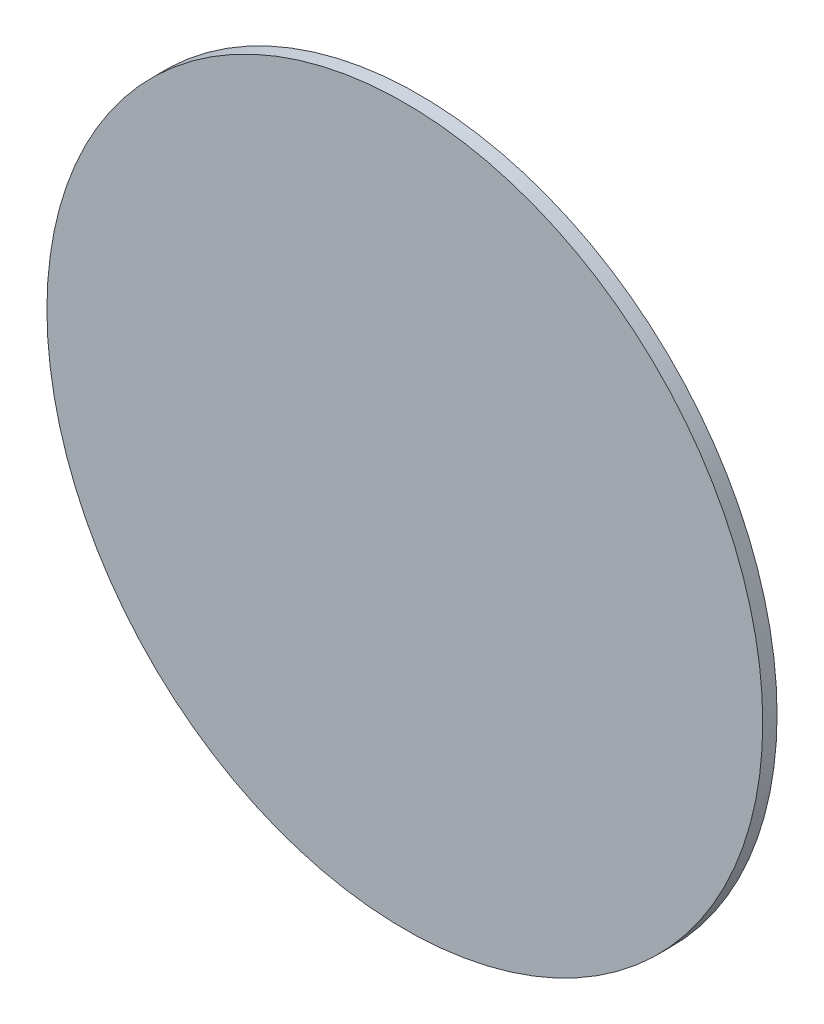
ISO-10303-21;
HEADER;
FILE_DESCRIPTION(('STEP AP214'),'2;1');
FILE_NAME('part.step','',(''),(''),'','','');
FILE_SCHEMA(('AUTOMOTIVE_DESIGN { 1 0 10303 214 1 1 1 1 }'));
ENDSEC;
DATA;
#1=APPLICATION_CONTEXT('core data for automotive mechanical design processes');
#2=APPLICATION_PROTOCOL_DEFINITION('international standard','automotive_design',2000,#1);
#3=PRODUCT_CONTEXT('',#1,'mechanical');
#4=PRODUCT('Part','Part','',(#3));
#5=PRODUCT_RELATED_PRODUCT_CATEGORY('part','',(#4));
#6=PRODUCT_DEFINITION_FORMATION('','',#4);
#7=PRODUCT_DEFINITION_CONTEXT('part definition',#1,'design');
#8=PRODUCT_DEFINITION('design','',#6,#7);
#9=PRODUCT_DEFINITION_SHAPE('','',#8);
#10=(LENGTH_UNIT() NAMED_UNIT(*) SI_UNIT(.MILLI.,.METRE.));
#11=(NAMED_UNIT(*) PLANE_ANGLE_UNIT() SI_UNIT($,.RADIAN.));
#12=(NAMED_UNIT(*) SI_UNIT($,.STERADIAN.) SOLID_ANGLE_UNIT());
#13=UNCERTAINTY_MEASURE_WITH_UNIT(LENGTH_MEASURE(1.E-05),#10,'distance_accuracy_value','');
#14=(GEOMETRIC_REPRESENTATION_CONTEXT(3) GLOBAL_UNCERTAINTY_ASSIGNED_CONTEXT((#13)) GLOBAL_UNIT_ASSIGNED_CONTEXT((#10,
#11,#12)) REPRESENTATION_CONTEXT('',''));
#15=CARTESIAN_POINT('',(0.,0.,0.));
#16=DIRECTION('',(0.,0.,1.));
#17=DIRECTION('',(1.,0.,0.));
#18=AXIS2_PLACEMENT_3D('',#15,#16,#17);
#19=CARTESIAN_POINT('',(0.,0.,4.));
#20=DIRECTION('',(0.,0.,1.));
#21=DIRECTION('',(1.,0.,0.));
#22=AXIS2_PLACEMENT_3D('',#19,#20,#21);
#23=PLANE('',#22);
#24=CARTESIAN_POINT('',(0.,0.,4.));
#25=DIRECTION('',(0.,0.,1.));
#26=DIRECTION('',(1.,0.,0.));
#27=AXIS2_PLACEMENT_3D('',#24,#25,#26);
#28=CIRCLE('',#27,100.);
#29=CARTESIAN_POINT('',(100.,0.,4.));
#30=VERTEX_POINT('',#29);
#31=EDGE_CURVE('E17',#30,#30,#28,.F.);
#32=ORIENTED_EDGE('',*,*,#31,.F.);
#33=EDGE_LOOP('',(#32));
#34=FACE_BOUND('',#33,.T.);
#35=ADVANCED_FACE('F14',(#34),#23,.T.);
#36=CARTESIAN_POINT('',(0.,0.,-282.842712474619));
#37=DIRECTION('',(0.,0.,1.));
#38=DIRECTION('',(1.,0.,0.));
#39=AXIS2_PLACEMENT_3D('',#36,#37,#38);
#40=CYLINDRICAL_SURFACE('',#39,100.);
#41=CARTESIAN_POINT('',(0.,0.,0.));
#42=DIRECTION('',(0.,0.,1.));
#43=DIRECTION('',(1.,0.,0.));
#44=AXIS2_PLACEMENT_3D('',#41,#42,#43);
#45=CIRCLE('',#44,100.);
#46=CARTESIAN_POINT('',(100.,0.,0.));
#47=VERTEX_POINT('',#46);
#48=EDGE_CURVE('E10',#47,#47,#45,.T.);
#49=ORIENTED_EDGE('',*,*,#48,.T.);
#50=EDGE_LOOP('',(#49));
#51=FACE_BOUND('',#50,.T.);
#52=ORIENTED_EDGE('',*,*,#31,.T.);
#53=EDGE_LOOP('',(#52));
#54=FACE_BOUND('',#53,.T.);
#55=ADVANCED_FACE('F26',(#51,#54),#40,.T.);
#56=CARTESIAN_POINT('',(0.,0.,0.));
#57=DIRECTION('',(0.,0.,1.));
#58=DIRECTION('',(1.,0.,0.));
#59=AXIS2_PLACEMENT_3D('',#56,#57,#58);
#60=PLANE('',#59);
#61=ORIENTED_EDGE('',*,*,#48,.F.);
#62=EDGE_LOOP('',(#61));
#63=FACE_BOUND('',#62,.T.);
#64=ADVANCED_FACE('F33',(#63),#60,.F.);
#65=CLOSED_SHELL('',(#35,#55,#64));
#66=MANIFOLD_SOLID_BREP('B1',#65);
#67=ADVANCED_BREP_SHAPE_REPRESENTATION('',(#18,#66),#14);
#68=SHAPE_DEFINITION_REPRESENTATION(#9,#67);
ENDSEC;
END-ISO-10303-21;
